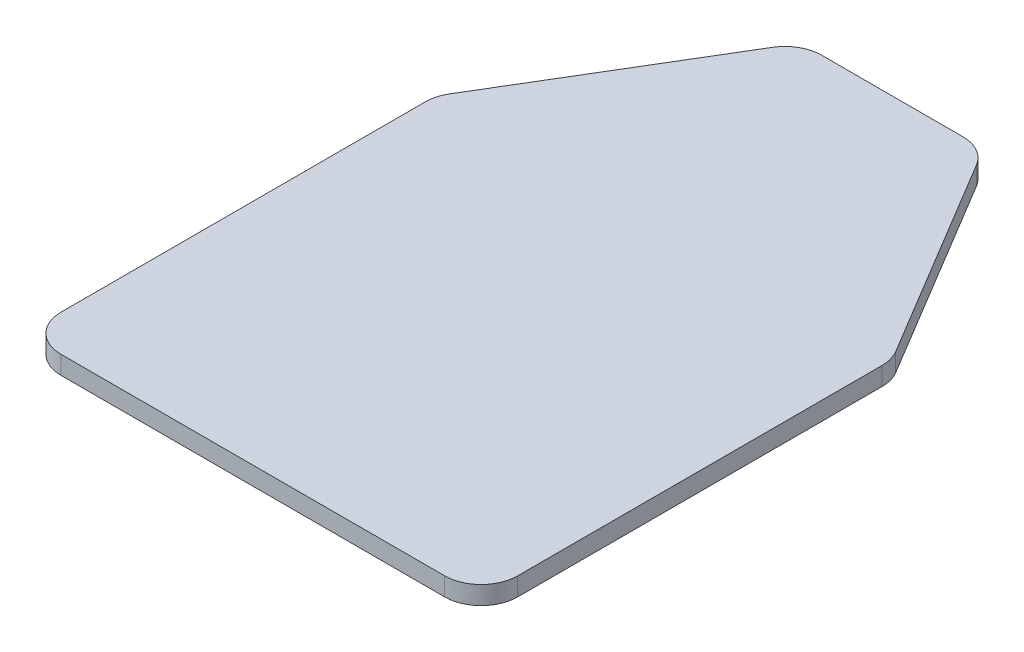
ISO-10303-21;
HEADER;
FILE_DESCRIPTION(('STEP AP214'),'2;1');
FILE_NAME('part.step','',(''),(''),'','','');
FILE_SCHEMA(('AUTOMOTIVE_DESIGN { 1 0 10303 214 1 1 1 1 }'));
ENDSEC;
DATA;
#1=APPLICATION_CONTEXT('core data for automotive mechanical design processes');
#2=APPLICATION_PROTOCOL_DEFINITION('international standard','automotive_design',2000,#1);
#3=PRODUCT_CONTEXT('',#1,'mechanical');
#4=PRODUCT('Part','Part','',(#3));
#5=PRODUCT_RELATED_PRODUCT_CATEGORY('part','',(#4));
#6=PRODUCT_DEFINITION_FORMATION('','',#4);
#7=PRODUCT_DEFINITION_CONTEXT('part definition',#1,'design');
#8=PRODUCT_DEFINITION('design','',#6,#7);
#9=PRODUCT_DEFINITION_SHAPE('','',#8);
#10=(LENGTH_UNIT() NAMED_UNIT(*) SI_UNIT(.MILLI.,.METRE.));
#11=(NAMED_UNIT(*) PLANE_ANGLE_UNIT() SI_UNIT($,.RADIAN.));
#12=(NAMED_UNIT(*) SI_UNIT($,.STERADIAN.) SOLID_ANGLE_UNIT());
#13=UNCERTAINTY_MEASURE_WITH_UNIT(LENGTH_MEASURE(1.E-05),#10,'distance_accuracy_value','');
#14=(GEOMETRIC_REPRESENTATION_CONTEXT(3) GLOBAL_UNCERTAINTY_ASSIGNED_CONTEXT((#13)) GLOBAL_UNIT_ASSIGNED_CONTEXT((#10,
#11,#12)) REPRESENTATION_CONTEXT('',''));
#15=CARTESIAN_POINT('',(0.,0.,0.));
#16=DIRECTION('',(0.,0.,1.));
#17=DIRECTION('',(1.,0.,0.));
#18=AXIS2_PLACEMENT_3D('',#15,#16,#17);
#19=CARTESIAN_POINT('',(-210.,20.,-39.9999999999999));
#20=DIRECTION('',(0.,-1.,0.));
#21=DIRECTION('',(0.,0.,-1.));
#22=AXIS2_PLACEMENT_3D('',#19,#20,#21);
#23=CYLINDRICAL_SURFACE('',#22,40.);
#24=CARTESIAN_POINT('',(-210.,0.,-39.9999999999999));
#25=DIRECTION('',(0.,1.,0.));
#26=DIRECTION('',(0.,0.,-1.));
#27=AXIS2_PLACEMENT_3D('',#24,#25,#26);
#28=CIRCLE('',#27,40.);
#29=CARTESIAN_POINT('',(-250.,0.,-39.9999999999999));
#30=VERTEX_POINT('',#29);
#31=CARTESIAN_POINT('',(-210.,0.,0.));
#32=VERTEX_POINT('',#31);
#33=EDGE_CURVE('E154',#30,#32,#28,.T.);
#34=ORIENTED_EDGE('',*,*,#33,.T.);
#35=DIRECTION('',(0.,-1.,0.));
#36=VECTOR('',#35,1.);
#37=CARTESIAN_POINT('',(-210.,20.,0.));
#38=LINE('',#37,#36);
#39=CARTESIAN_POINT('',(-210.,20.,0.));
#40=VERTEX_POINT('',#39);
#41=EDGE_CURVE('E11',#40,#32,#38,.T.);
#42=ORIENTED_EDGE('',*,*,#41,.F.);
#43=CARTESIAN_POINT('',(-210.,20.,-39.9999999999999));
#44=DIRECTION('',(0.,1.,0.));
#45=DIRECTION('',(0.,0.,-1.));
#46=AXIS2_PLACEMENT_3D('',#43,#44,#45);
#47=CIRCLE('',#46,40.);
#48=CARTESIAN_POINT('',(-250.,20.,-39.9999999999999));
#49=VERTEX_POINT('',#48);
#50=EDGE_CURVE('E176',#49,#40,#47,.T.);
#51=ORIENTED_EDGE('',*,*,#50,.F.);
#52=DIRECTION('',(0.,-1.,0.));
#53=VECTOR('',#52,1.);
#54=CARTESIAN_POINT('',(-250.,20.,-39.9999999999999));
#55=LINE('',#54,#53);
#56=EDGE_CURVE('E150',#49,#30,#55,.T.);
#57=ORIENTED_EDGE('',*,*,#56,.T.);
#58=EDGE_LOOP('',(#34,#42,#51,#57));
#59=FACE_BOUND('',#58,.T.);
#60=ADVANCED_FACE('F34',(#59),#23,.T.);
#61=CARTESIAN_POINT('',(210.,20.,0.));
#62=DIRECTION('',(0.,0.,-1.));
#63=DIRECTION('',(-1.,0.,0.));
#64=AXIS2_PLACEMENT_3D('',#61,#62,#63);
#65=PLANE('',#64);
#66=DIRECTION('',(1.,0.,0.));
#67=VECTOR('',#66,1.);
#68=CARTESIAN_POINT('',(210.,0.,0.));
#69=LINE('',#68,#67);
#70=CARTESIAN_POINT('',(210.,0.,0.));
#71=VERTEX_POINT('',#70);
#72=EDGE_CURVE('E157',#32,#71,#69,.T.);
#73=ORIENTED_EDGE('',*,*,#72,.T.);
#74=DIRECTION('',(0.,-1.,0.));
#75=VECTOR('',#74,1.);
#76=CARTESIAN_POINT('',(210.,20.,0.));
#77=LINE('',#76,#75);
#78=CARTESIAN_POINT('',(210.,20.,0.));
#79=VERTEX_POINT('',#78);
#80=EDGE_CURVE('E42',#79,#71,#77,.T.);
#81=ORIENTED_EDGE('',*,*,#80,.F.);
#82=DIRECTION('',(1.,0.,0.));
#83=VECTOR('',#82,1.);
#84=CARTESIAN_POINT('',(210.,20.,0.));
#85=LINE('',#84,#83);
#86=EDGE_CURVE('E105',#40,#79,#85,.T.);
#87=ORIENTED_EDGE('',*,*,#86,.F.);
#88=ORIENTED_EDGE('',*,*,#41,.T.);
#89=EDGE_LOOP('',(#73,#81,#87,#88));
#90=FACE_BOUND('',#89,.T.);
#91=ADVANCED_FACE('F254',(#90),#65,.F.);
#92=CARTESIAN_POINT('',(210.,20.,-39.9999999999999));
#93=DIRECTION('',(0.,-1.,0.));
#94=DIRECTION('',(0.,0.,-1.));
#95=AXIS2_PLACEMENT_3D('',#92,#93,#94);
#96=CYLINDRICAL_SURFACE('',#95,40.);
#97=CARTESIAN_POINT('',(210.,0.,-39.9999999999999));
#98=DIRECTION('',(0.,1.,0.));
#99=DIRECTION('',(0.,0.,1.));
#100=AXIS2_PLACEMENT_3D('',#97,#98,#99);
#101=CIRCLE('',#100,40.);
#102=CARTESIAN_POINT('',(250.,0.,-39.9999999999999));
#103=VERTEX_POINT('',#102);
#104=EDGE_CURVE('E159',#71,#103,#101,.T.);
#105=ORIENTED_EDGE('',*,*,#104,.T.);
#106=DIRECTION('',(0.,-1.,0.));
#107=VECTOR('',#106,1.);
#108=CARTESIAN_POINT('',(250.,20.,-39.9999999999999));
#109=LINE('',#108,#107);
#110=CARTESIAN_POINT('',(250.,20.,-39.9999999999999));
#111=VERTEX_POINT('',#110);
#112=EDGE_CURVE('E195',#111,#103,#109,.T.);
#113=ORIENTED_EDGE('',*,*,#112,.F.);
#114=CARTESIAN_POINT('',(210.,20.,-39.9999999999999));
#115=DIRECTION('',(0.,1.,0.));
#116=DIRECTION('',(0.,0.,1.));
#117=AXIS2_PLACEMENT_3D('',#114,#115,#116);
#118=CIRCLE('',#117,40.);
#119=EDGE_CURVE('E203',#79,#111,#118,.T.);
#120=ORIENTED_EDGE('',*,*,#119,.F.);
#121=ORIENTED_EDGE('',*,*,#80,.T.);
#122=EDGE_LOOP('',(#105,#113,#120,#121));
#123=FACE_BOUND('',#122,.T.);
#124=ADVANCED_FACE('F201',(#123),#96,.T.);
#125=CARTESIAN_POINT('',(250.,20.,-39.9999999999999));
#126=DIRECTION('',(-1.,0.,0.));
#127=DIRECTION('',(0.,0.,1.));
#128=AXIS2_PLACEMENT_3D('',#125,#126,#127);
#129=PLANE('',#128);
#130=DIRECTION('',(0.,0.,-1.));
#131=VECTOR('',#130,1.);
#132=CARTESIAN_POINT('',(250.,0.,-39.9999999999999));
#133=LINE('',#132,#131);
#134=CARTESIAN_POINT('',(250.,0.,-438.920641402063));
#135=VERTEX_POINT('',#134);
#136=EDGE_CURVE('E161',#103,#135,#133,.T.);
#137=ORIENTED_EDGE('',*,*,#136,.T.);
#138=DIRECTION('',(0.,-1.,0.));
#139=VECTOR('',#138,1.);
#140=CARTESIAN_POINT('',(250.,20.,-438.920641402063));
#141=LINE('',#140,#139);
#142=CARTESIAN_POINT('',(250.,20.,-438.920641402063));
#143=VERTEX_POINT('',#142);
#144=EDGE_CURVE('E192',#143,#135,#141,.T.);
#145=ORIENTED_EDGE('',*,*,#144,.F.);
#146=DIRECTION('',(0.,0.,-1.));
#147=VECTOR('',#146,1.);
#148=CARTESIAN_POINT('',(250.,20.,-39.9999999999999));
#149=LINE('',#148,#147);
#150=EDGE_CURVE('E221',#111,#143,#149,.T.);
#151=ORIENTED_EDGE('',*,*,#150,.F.);
#152=ORIENTED_EDGE('',*,*,#112,.T.);
#153=EDGE_LOOP('',(#137,#145,#151,#152));
#154=FACE_BOUND('',#153,.T.);
#155=ADVANCED_FACE('F212',(#154),#129,.F.);
#156=CARTESIAN_POINT('',(210.,20.,-438.920641402063));
#157=DIRECTION('',(0.,-1.,0.));
#158=DIRECTION('',(0.,0.,-1.));
#159=AXIS2_PLACEMENT_3D('',#156,#157,#158);
#160=CYLINDRICAL_SURFACE('',#159,40.);
#161=CARTESIAN_POINT('',(210.,0.,-438.920641402063));
#162=DIRECTION('',(0.,1.,0.));
#163=DIRECTION('',(0.,0.,1.));
#164=AXIS2_PLACEMENT_3D('',#161,#162,#163);
#165=CIRCLE('',#164,40.);
#166=CARTESIAN_POINT('',(244.299717028502,0.,-459.500471619164));
#167=VERTEX_POINT('',#166);
#168=EDGE_CURVE('E163',#135,#167,#165,.T.);
#169=ORIENTED_EDGE('',*,*,#168,.T.);
#170=DIRECTION('',(0.,-1.,0.));
#171=VECTOR('',#170,1.);
#172=CARTESIAN_POINT('',(244.299717028502,20.,-459.500471619164));
#173=LINE('',#172,#171);
#174=CARTESIAN_POINT('',(244.299717028502,20.,-459.500471619164));
#175=VERTEX_POINT('',#174);
#176=EDGE_CURVE('E189',#175,#167,#173,.T.);
#177=ORIENTED_EDGE('',*,*,#176,.F.);
#178=CARTESIAN_POINT('',(210.,20.,-438.920641402063));
#179=DIRECTION('',(0.,1.,0.));
#180=DIRECTION('',(0.,0.,1.));
#181=AXIS2_PLACEMENT_3D('',#178,#179,#180);
#182=CIRCLE('',#181,40.);
#183=EDGE_CURVE('E218',#143,#175,#182,.T.);
#184=ORIENTED_EDGE('',*,*,#183,.F.);
#185=ORIENTED_EDGE('',*,*,#144,.T.);
#186=EDGE_LOOP('',(#169,#177,#184,#185));
#187=FACE_BOUND('',#186,.T.);
#188=ADVANCED_FACE('F216',(#187),#160,.T.);
#189=CARTESIAN_POINT('',(244.299717028502,20.,-459.500471619164));
#190=DIRECTION('',(-0.857492925712544,0.,0.514495755427527));
#191=DIRECTION('',(0.514495755427527,0.,0.857492925712544));
#192=AXIS2_PLACEMENT_3D('',#189,#190,#191);
#193=PLANE('',#192);
#194=DIRECTION('',(-0.514495755427527,0.,-0.857492925712544));
#195=VECTOR('',#194,1.);
#196=CARTESIAN_POINT('',(244.299717028502,0.,-459.500471619164));
#197=LINE('',#196,#195);
#198=CARTESIAN_POINT('',(111.652101869739,0.,-680.579830217101));
#199=VERTEX_POINT('',#198);
#200=EDGE_CURVE('E165',#167,#199,#197,.T.);
#201=ORIENTED_EDGE('',*,*,#200,.T.);
#202=DIRECTION('',(0.,-1.,0.));
#203=VECTOR('',#202,1.);
#204=CARTESIAN_POINT('',(111.652101869739,20.,-680.579830217101));
#205=LINE('',#204,#203);
#206=CARTESIAN_POINT('',(111.652101869739,20.,-680.579830217101));
#207=VERTEX_POINT('',#206);
#208=EDGE_CURVE('E186',#207,#199,#205,.T.);
#209=ORIENTED_EDGE('',*,*,#208,.F.);
#210=DIRECTION('',(-0.514495755427527,0.,-0.857492925712544));
#211=VECTOR('',#210,1.);
#212=CARTESIAN_POINT('',(244.299717028502,20.,-459.500471619164));
#213=LINE('',#212,#211);
#214=EDGE_CURVE('E220',#175,#207,#213,.T.);
#215=ORIENTED_EDGE('',*,*,#214,.F.);
#216=ORIENTED_EDGE('',*,*,#176,.T.);
#217=EDGE_LOOP('',(#201,#209,#215,#216));
#218=FACE_BOUND('',#217,.T.);
#219=ADVANCED_FACE('F267',(#218),#193,.F.);
#220=CARTESIAN_POINT('',(77.3523848412376,20.,-660.));
#221=DIRECTION('',(0.,-1.,0.));
#222=DIRECTION('',(0.,0.,-1.));
#223=AXIS2_PLACEMENT_3D('',#220,#221,#222);
#224=CYLINDRICAL_SURFACE('',#223,40.);
#225=CARTESIAN_POINT('',(77.3523848412376,0.,-660.));
#226=DIRECTION('',(0.,1.,0.));
#227=DIRECTION('',(0.,0.,1.));
#228=AXIS2_PLACEMENT_3D('',#225,#226,#227);
#229=CIRCLE('',#228,40.);
#230=CARTESIAN_POINT('',(77.3523848412376,0.,-700.));
#231=VERTEX_POINT('',#230);
#232=EDGE_CURVE('E167',#199,#231,#229,.T.);
#233=ORIENTED_EDGE('',*,*,#232,.T.);
#234=DIRECTION('',(0.,-1.,0.));
#235=VECTOR('',#234,1.);
#236=CARTESIAN_POINT('',(77.3523848412376,20.,-700.));
#237=LINE('',#236,#235);
#238=CARTESIAN_POINT('',(77.3523848412376,20.,-700.));
#239=VERTEX_POINT('',#238);
#240=EDGE_CURVE('E183',#239,#231,#237,.T.);
#241=ORIENTED_EDGE('',*,*,#240,.F.);
#242=CARTESIAN_POINT('',(77.3523848412376,20.,-660.));
#243=DIRECTION('',(0.,1.,0.));
#244=DIRECTION('',(0.,0.,1.));
#245=AXIS2_PLACEMENT_3D('',#242,#243,#244);
#246=CIRCLE('',#245,40.);
#247=EDGE_CURVE('E223',#207,#239,#246,.T.);
#248=ORIENTED_EDGE('',*,*,#247,.F.);
#249=ORIENTED_EDGE('',*,*,#208,.T.);
#250=EDGE_LOOP('',(#233,#241,#248,#249));
#251=FACE_BOUND('',#250,.T.);
#252=ADVANCED_FACE('F270',(#251),#224,.T.);
#253=CARTESIAN_POINT('',(-77.3523848412376,20.,-700.));
#254=DIRECTION('',(0.,0.,1.));
#255=DIRECTION('',(1.,0.,0.));
#256=AXIS2_PLACEMENT_3D('',#253,#254,#255);
#257=PLANE('',#256);
#258=DIRECTION('',(-1.,0.,0.));
#259=VECTOR('',#258,1.);
#260=CARTESIAN_POINT('',(-77.3523848412376,0.,-700.));
#261=LINE('',#260,#259);
#262=CARTESIAN_POINT('',(-77.3523848412376,0.,-700.));
#263=VERTEX_POINT('',#262);
#264=EDGE_CURVE('E169',#231,#263,#261,.T.);
#265=ORIENTED_EDGE('',*,*,#264,.T.);
#266=DIRECTION('',(0.,-1.,0.));
#267=VECTOR('',#266,1.);
#268=CARTESIAN_POINT('',(-77.3523848412376,20.,-700.));
#269=LINE('',#268,#267);
#270=CARTESIAN_POINT('',(-77.3523848412376,20.,-700.));
#271=VERTEX_POINT('',#270);
#272=EDGE_CURVE('E180',#271,#263,#269,.T.);
#273=ORIENTED_EDGE('',*,*,#272,.F.);
#274=DIRECTION('',(-1.,0.,0.));
#275=VECTOR('',#274,1.);
#276=CARTESIAN_POINT('',(-77.3523848412376,20.,-700.));
#277=LINE('',#276,#275);
#278=EDGE_CURVE('E229',#239,#271,#277,.T.);
#279=ORIENTED_EDGE('',*,*,#278,.F.);
#280=ORIENTED_EDGE('',*,*,#240,.T.);
#281=EDGE_LOOP('',(#265,#273,#279,#280));
#282=FACE_BOUND('',#281,.T.);
#283=ADVANCED_FACE('F235',(#282),#257,.F.);
#284=CARTESIAN_POINT('',(-77.3523848412376,20.,-660.));
#285=DIRECTION('',(0.,-1.,0.));
#286=DIRECTION('',(0.,0.,-1.));
#287=AXIS2_PLACEMENT_3D('',#284,#285,#286);
#288=CYLINDRICAL_SURFACE('',#287,40.);
#289=CARTESIAN_POINT('',(-77.3523848412376,0.,-660.));
#290=DIRECTION('',(0.,1.,0.));
#291=DIRECTION('',(0.,0.,-1.));
#292=AXIS2_PLACEMENT_3D('',#289,#290,#291);
#293=CIRCLE('',#292,40.);
#294=CARTESIAN_POINT('',(-111.652101869739,0.,-680.579830217101));
#295=VERTEX_POINT('',#294);
#296=EDGE_CURVE('E171',#263,#295,#293,.T.);
#297=ORIENTED_EDGE('',*,*,#296,.T.);
#298=DIRECTION('',(0.,-1.,0.));
#299=VECTOR('',#298,1.);
#300=CARTESIAN_POINT('',(-111.652101869739,20.,-680.579830217101));
#301=LINE('',#300,#299);
#302=CARTESIAN_POINT('',(-111.652101869739,20.,-680.579830217101));
#303=VERTEX_POINT('',#302);
#304=EDGE_CURVE('E145',#303,#295,#301,.T.);
#305=ORIENTED_EDGE('',*,*,#304,.F.);
#306=CARTESIAN_POINT('',(-77.3523848412376,20.,-660.));
#307=DIRECTION('',(0.,1.,0.));
#308=DIRECTION('',(0.,0.,-1.));
#309=AXIS2_PLACEMENT_3D('',#306,#307,#308);
#310=CIRCLE('',#309,40.);
#311=EDGE_CURVE('E136',#271,#303,#310,.T.);
#312=ORIENTED_EDGE('',*,*,#311,.F.);
#313=ORIENTED_EDGE('',*,*,#272,.T.);
#314=EDGE_LOOP('',(#297,#305,#312,#313));
#315=FACE_BOUND('',#314,.T.);
#316=ADVANCED_FACE('F239',(#315),#288,.T.);
#317=CARTESIAN_POINT('',(-244.299717028502,20.,-459.500471619164));
#318=DIRECTION('',(0.857492925712544,0.,0.514495755427527));
#319=DIRECTION('',(0.514495755427527,0.,-0.857492925712544));
#320=AXIS2_PLACEMENT_3D('',#317,#318,#319);
#321=PLANE('',#320);
#322=DIRECTION('',(-0.514495755427527,0.,0.857492925712544));
#323=VECTOR('',#322,1.);
#324=CARTESIAN_POINT('',(-244.299717028502,0.,-459.500471619164));
#325=LINE('',#324,#323);
#326=CARTESIAN_POINT('',(-244.299717028502,0.,-459.500471619164));
#327=VERTEX_POINT('',#326);
#328=EDGE_CURVE('E144',#295,#327,#325,.T.);
#329=ORIENTED_EDGE('',*,*,#328,.T.);
#330=DIRECTION('',(0.,-1.,0.));
#331=VECTOR('',#330,1.);
#332=CARTESIAN_POINT('',(-244.299717028502,20.,-459.500471619164));
#333=LINE('',#332,#331);
#334=CARTESIAN_POINT('',(-244.299717028502,20.,-459.500471619164));
#335=VERTEX_POINT('',#334);
#336=EDGE_CURVE('E141',#335,#327,#333,.T.);
#337=ORIENTED_EDGE('',*,*,#336,.F.);
#338=DIRECTION('',(-0.514495755427527,0.,0.857492925712544));
#339=VECTOR('',#338,1.);
#340=CARTESIAN_POINT('',(-244.299717028502,20.,-459.500471619164));
#341=LINE('',#340,#339);
#342=EDGE_CURVE('E130',#303,#335,#341,.T.);
#343=ORIENTED_EDGE('',*,*,#342,.F.);
#344=ORIENTED_EDGE('',*,*,#304,.T.);
#345=EDGE_LOOP('',(#329,#337,#343,#344));
#346=FACE_BOUND('',#345,.T.);
#347=ADVANCED_FACE('F142',(#346),#321,.F.);
#348=CARTESIAN_POINT('',(-210.,20.,-438.920641402063));
#349=DIRECTION('',(0.,-1.,0.));
#350=DIRECTION('',(0.,0.,-1.));
#351=AXIS2_PLACEMENT_3D('',#348,#349,#350);
#352=CYLINDRICAL_SURFACE('',#351,40.);
#353=CARTESIAN_POINT('',(-210.,0.,-438.920641402063));
#354=DIRECTION('',(0.,1.,0.));
#355=DIRECTION('',(0.,0.,-1.));
#356=AXIS2_PLACEMENT_3D('',#353,#354,#355);
#357=CIRCLE('',#356,40.);
#358=CARTESIAN_POINT('',(-250.,0.,-438.920641402063));
#359=VERTEX_POINT('',#358);
#360=EDGE_CURVE('E91',#327,#359,#357,.T.);
#361=ORIENTED_EDGE('',*,*,#360,.T.);
#362=DIRECTION('',(0.,-1.,0.));
#363=VECTOR('',#362,1.);
#364=CARTESIAN_POINT('',(-250.,20.,-438.920641402063));
#365=LINE('',#364,#363);
#366=CARTESIAN_POINT('',(-250.,20.,-438.920641402063));
#367=VERTEX_POINT('',#366);
#368=EDGE_CURVE('E146',#367,#359,#365,.T.);
#369=ORIENTED_EDGE('',*,*,#368,.F.);
#370=CARTESIAN_POINT('',(-210.,20.,-438.920641402063));
#371=DIRECTION('',(0.,1.,0.));
#372=DIRECTION('',(0.,0.,-1.));
#373=AXIS2_PLACEMENT_3D('',#370,#371,#372);
#374=CIRCLE('',#373,40.);
#375=EDGE_CURVE('E134',#335,#367,#374,.T.);
#376=ORIENTED_EDGE('',*,*,#375,.F.);
#377=ORIENTED_EDGE('',*,*,#336,.T.);
#378=EDGE_LOOP('',(#361,#369,#376,#377));
#379=FACE_BOUND('',#378,.T.);
#380=ADVANCED_FACE('F148',(#379),#352,.T.);
#381=CARTESIAN_POINT('',(-250.,20.,-39.9999999999999));
#382=DIRECTION('',(1.,0.,0.));
#383=DIRECTION('',(0.,0.,-1.));
#384=AXIS2_PLACEMENT_3D('',#381,#382,#383);
#385=PLANE('',#384);
#386=DIRECTION('',(0.,0.,1.));
#387=VECTOR('',#386,1.);
#388=CARTESIAN_POINT('',(-250.,0.,-39.9999999999999));
#389=LINE('',#388,#387);
#390=EDGE_CURVE('E97',#359,#30,#389,.T.);
#391=ORIENTED_EDGE('',*,*,#390,.T.);
#392=ORIENTED_EDGE('',*,*,#56,.F.);
#393=DIRECTION('',(0.,0.,1.));
#394=VECTOR('',#393,1.);
#395=CARTESIAN_POINT('',(-250.,20.,-39.9999999999999));
#396=LINE('',#395,#394);
#397=EDGE_CURVE('E50',#367,#49,#396,.T.);
#398=ORIENTED_EDGE('',*,*,#397,.F.);
#399=ORIENTED_EDGE('',*,*,#368,.T.);
#400=EDGE_LOOP('',(#391,#392,#398,#399));
#401=FACE_BOUND('',#400,.T.);
#402=ADVANCED_FACE('F243',(#401),#385,.F.);
#403=CARTESIAN_POINT('',(-210.,20.,-39.9999999999999));
#404=DIRECTION('',(0.,-1.,0.));
#405=DIRECTION('',(0.,0.,-1.));
#406=AXIS2_PLACEMENT_3D('',#403,#404,#405);
#407=PLANE('',#406);
#408=ORIENTED_EDGE('',*,*,#50,.T.);
#409=ORIENTED_EDGE('',*,*,#86,.T.);
#410=ORIENTED_EDGE('',*,*,#119,.T.);
#411=ORIENTED_EDGE('',*,*,#150,.T.);
#412=ORIENTED_EDGE('',*,*,#183,.T.);
#413=ORIENTED_EDGE('',*,*,#214,.T.);
#414=ORIENTED_EDGE('',*,*,#247,.T.);
#415=ORIENTED_EDGE('',*,*,#278,.T.);
#416=ORIENTED_EDGE('',*,*,#311,.T.);
#417=ORIENTED_EDGE('',*,*,#342,.T.);
#418=ORIENTED_EDGE('',*,*,#375,.T.);
#419=ORIENTED_EDGE('',*,*,#397,.T.);
#420=EDGE_LOOP('',(#408,#409,#410,#411,#412,#413,#414,#415,#416,#417,#418,#419));
#421=FACE_BOUND('',#420,.T.);
#422=ADVANCED_FACE('F132',(#421),#407,.F.);
#423=CARTESIAN_POINT('',(-210.,0.,-39.9999999999999));
#424=DIRECTION('',(0.,-1.,0.));
#425=DIRECTION('',(0.,0.,-1.));
#426=AXIS2_PLACEMENT_3D('',#423,#424,#425);
#427=PLANE('',#426);
#428=ORIENTED_EDGE('',*,*,#33,.F.);
#429=ORIENTED_EDGE('',*,*,#390,.F.);
#430=ORIENTED_EDGE('',*,*,#360,.F.);
#431=ORIENTED_EDGE('',*,*,#328,.F.);
#432=ORIENTED_EDGE('',*,*,#296,.F.);
#433=ORIENTED_EDGE('',*,*,#264,.F.);
#434=ORIENTED_EDGE('',*,*,#232,.F.);
#435=ORIENTED_EDGE('',*,*,#200,.F.);
#436=ORIENTED_EDGE('',*,*,#168,.F.);
#437=ORIENTED_EDGE('',*,*,#136,.F.);
#438=ORIENTED_EDGE('',*,*,#104,.F.);
#439=ORIENTED_EDGE('',*,*,#72,.F.);
#440=EDGE_LOOP('',(#428,#429,#430,#431,#432,#433,#434,#435,#436,#437,#438,#439));
#441=FACE_BOUND('',#440,.T.);
#442=ADVANCED_FACE('F207',(#441),#427,.T.);
#443=CLOSED_SHELL('',(#60,#91,#124,#155,#188,#219,#252,#283,#316,#347,#380,#402,#422,#442));
#444=MANIFOLD_SOLID_BREP('B2',#443);
#445=ADVANCED_BREP_SHAPE_REPRESENTATION('',(#18,#444),#14);
#446=SHAPE_DEFINITION_REPRESENTATION(#9,#445);
ENDSEC;
END-ISO-10303-21;
